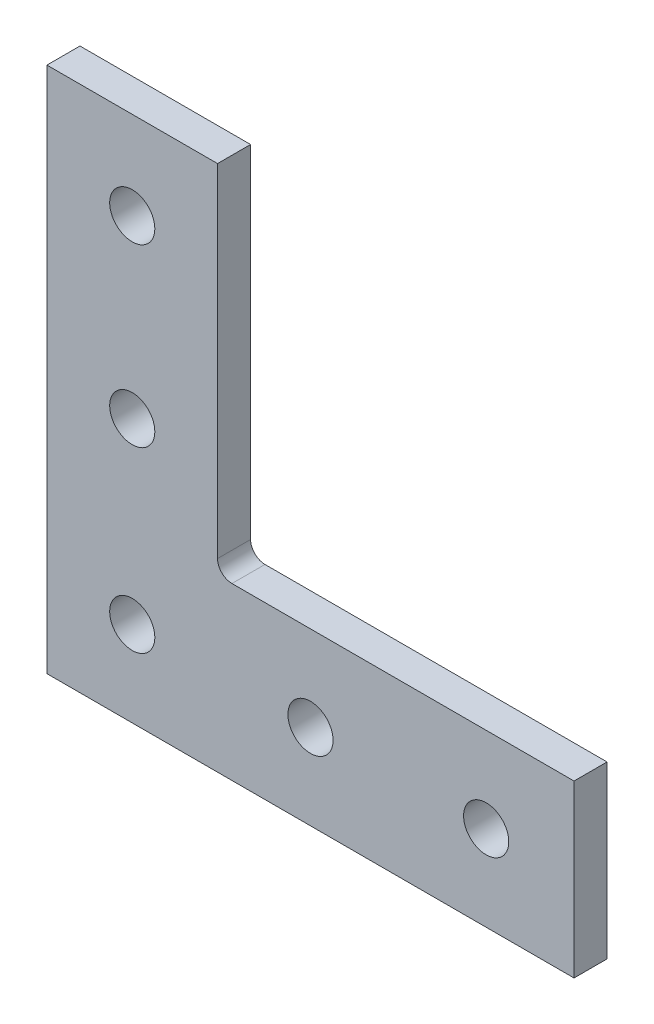
ISO-10303-21;
HEADER;
FILE_DESCRIPTION(('STEP AP214'),'2;1');
FILE_NAME('part.step','',(''),(''),'','','');
FILE_SCHEMA(('AUTOMOTIVE_DESIGN { 1 0 10303 214 1 1 1 1 }'));
ENDSEC;
DATA;
#1=APPLICATION_CONTEXT('core data for automotive mechanical design processes');
#2=APPLICATION_PROTOCOL_DEFINITION('international standard','automotive_design',2000,#1);
#3=PRODUCT_CONTEXT('',#1,'mechanical');
#4=PRODUCT('Part','Part','',(#3));
#5=PRODUCT_RELATED_PRODUCT_CATEGORY('part','',(#4));
#6=PRODUCT_DEFINITION_FORMATION('','',#4);
#7=PRODUCT_DEFINITION_CONTEXT('part definition',#1,'design');
#8=PRODUCT_DEFINITION('design','',#6,#7);
#9=PRODUCT_DEFINITION_SHAPE('','',#8);
#10=(LENGTH_UNIT() NAMED_UNIT(*) SI_UNIT(.MILLI.,.METRE.));
#11=(NAMED_UNIT(*) PLANE_ANGLE_UNIT() SI_UNIT($,.RADIAN.));
#12=(NAMED_UNIT(*) SI_UNIT($,.STERADIAN.) SOLID_ANGLE_UNIT());
#13=UNCERTAINTY_MEASURE_WITH_UNIT(LENGTH_MEASURE(1.E-05),#10,'distance_accuracy_value','');
#14=(GEOMETRIC_REPRESENTATION_CONTEXT(3) GLOBAL_UNCERTAINTY_ASSIGNED_CONTEXT((#13)) GLOBAL_UNIT_ASSIGNED_CONTEXT((#10,
#11,#12)) REPRESENTATION_CONTEXT('',''));
#15=CARTESIAN_POINT('',(0.,0.,0.));
#16=DIRECTION('',(0.,0.,1.));
#17=DIRECTION('',(1.,0.,0.));
#18=AXIS2_PLACEMENT_3D('',#15,#16,#17);
#19=CARTESIAN_POINT('',(-13.4366,-11.3538,-2.3876));
#20=DIRECTION('',(1.,0.,0.));
#21=DIRECTION('',(0.,1.,0.));
#22=AXIS2_PLACEMENT_3D('',#19,#20,#21);
#23=PLANE('',#22);
#24=DIRECTION('',(0.,0.,1.));
#25=VECTOR('',#24,1.);
#26=CARTESIAN_POINT('',(-13.4366,38.1,-2.3876));
#27=LINE('',#26,#25);
#28=CARTESIAN_POINT('',(-13.4366,38.1,-2.3876));
#29=VERTEX_POINT('',#28);
#30=CARTESIAN_POINT('',(-13.4366,38.1,2.3876));
#31=VERTEX_POINT('',#30);
#32=EDGE_CURVE('E88',#29,#31,#27,.T.);
#33=ORIENTED_EDGE('',*,*,#32,.T.);
#34=DIRECTION('',(0.,1.,0.));
#35=VECTOR('',#34,1.);
#36=CARTESIAN_POINT('',(-13.4366,-11.3538,2.3876));
#37=LINE('',#36,#35);
#38=CARTESIAN_POINT('',(-13.4366,-11.3538,2.3876));
#39=VERTEX_POINT('',#38);
#40=EDGE_CURVE('E91',#39,#31,#37,.T.);
#41=ORIENTED_EDGE('',*,*,#40,.F.);
#42=DIRECTION('',(0.,0.,1.));
#43=VECTOR('',#42,1.);
#44=CARTESIAN_POINT('',(-13.4366,-11.3538,-2.3876));
#45=LINE('',#44,#43);
#46=CARTESIAN_POINT('',(-13.4366,-11.3538,-2.3876));
#47=VERTEX_POINT('',#46);
#48=EDGE_CURVE('E11',#47,#39,#45,.T.);
#49=ORIENTED_EDGE('',*,*,#48,.F.);
#50=DIRECTION('',(0.,1.,0.));
#51=VECTOR('',#50,1.);
#52=CARTESIAN_POINT('',(-13.4366,-11.3538,-2.3876));
#53=LINE('',#52,#51);
#54=EDGE_CURVE('E92',#47,#29,#53,.T.);
#55=ORIENTED_EDGE('',*,*,#54,.T.);
#56=EDGE_LOOP('',(#33,#41,#49,#55));
#57=FACE_BOUND('',#56,.T.);
#58=ADVANCED_FACE('F32',(#57),#23,.T.);
#59=CARTESIAN_POINT('',(-11.3538,-11.3538,-2.3876));
#60=DIRECTION('',(0.,0.,1.));
#61=DIRECTION('',(1.,0.,0.));
#62=AXIS2_PLACEMENT_3D('',#59,#60,#61);
#63=CYLINDRICAL_SURFACE('',#62,2.0828);
#64=ORIENTED_EDGE('',*,*,#48,.T.);
#65=CARTESIAN_POINT('',(-11.3538,-11.3538,2.3876));
#66=DIRECTION('',(0.,0.,-1.));
#67=DIRECTION('',(-1.,0.,0.));
#68=AXIS2_PLACEMENT_3D('',#65,#66,#67);
#69=CIRCLE('',#68,2.0828);
#70=CARTESIAN_POINT('',(-11.3538,-13.4366,2.3876));
#71=VERTEX_POINT('',#70);
#72=EDGE_CURVE('E110',#71,#39,#69,.T.);
#73=ORIENTED_EDGE('',*,*,#72,.F.);
#74=DIRECTION('',(0.,0.,1.));
#75=VECTOR('',#74,1.);
#76=CARTESIAN_POINT('',(-11.3538,-13.4366,-2.3876));
#77=LINE('',#76,#75);
#78=CARTESIAN_POINT('',(-11.3538,-13.4366,-2.3876));
#79=VERTEX_POINT('',#78);
#80=EDGE_CURVE('E40',#79,#71,#77,.T.);
#81=ORIENTED_EDGE('',*,*,#80,.F.);
#82=CARTESIAN_POINT('',(-11.3538,-11.3538,-2.3876));
#83=DIRECTION('',(0.,0.,-1.));
#84=DIRECTION('',(-1.,0.,0.));
#85=AXIS2_PLACEMENT_3D('',#82,#83,#84);
#86=CIRCLE('',#85,2.0828);
#87=EDGE_CURVE('E97',#79,#47,#86,.T.);
#88=ORIENTED_EDGE('',*,*,#87,.T.);
#89=EDGE_LOOP('',(#64,#73,#81,#88));
#90=FACE_BOUND('',#89,.T.);
#91=ADVANCED_FACE('F183',(#90),#63,.F.);
#92=CARTESIAN_POINT('',(38.1,-13.4366,-2.3876));
#93=DIRECTION('',(0.,1.,0.));
#94=DIRECTION('',(-1.,0.,0.));
#95=AXIS2_PLACEMENT_3D('',#92,#93,#94);
#96=PLANE('',#95);
#97=ORIENTED_EDGE('',*,*,#80,.T.);
#98=DIRECTION('',(-1.,0.,0.));
#99=VECTOR('',#98,1.);
#100=CARTESIAN_POINT('',(38.1,-13.4366,2.3876));
#101=LINE('',#100,#99);
#102=CARTESIAN_POINT('',(38.1,-13.4366,2.3876));
#103=VERTEX_POINT('',#102);
#104=EDGE_CURVE('E125',#103,#71,#101,.T.);
#105=ORIENTED_EDGE('',*,*,#104,.F.);
#106=DIRECTION('',(0.,0.,1.));
#107=VECTOR('',#106,1.);
#108=CARTESIAN_POINT('',(38.1,-13.4366,-2.3876));
#109=LINE('',#108,#107);
#110=CARTESIAN_POINT('',(38.1,-13.4366,-2.3876));
#111=VERTEX_POINT('',#110);
#112=EDGE_CURVE('E144',#111,#103,#109,.T.);
#113=ORIENTED_EDGE('',*,*,#112,.F.);
#114=DIRECTION('',(-1.,0.,0.));
#115=VECTOR('',#114,1.);
#116=CARTESIAN_POINT('',(38.1,-13.4366,-2.3876));
#117=LINE('',#116,#115);
#118=EDGE_CURVE('E140',#111,#79,#117,.T.);
#119=ORIENTED_EDGE('',*,*,#118,.T.);
#120=EDGE_LOOP('',(#97,#105,#113,#119));
#121=FACE_BOUND('',#120,.T.);
#122=ADVANCED_FACE('F187',(#121),#96,.T.);
#123=CARTESIAN_POINT('',(38.1,-38.1,-2.3876));
#124=DIRECTION('',(1.,0.,0.));
#125=DIRECTION('',(0.,0.,-1.));
#126=AXIS2_PLACEMENT_3D('',#123,#124,#125);
#127=PLANE('',#126);
#128=ORIENTED_EDGE('',*,*,#112,.T.);
#129=DIRECTION('',(0.,1.,0.));
#130=VECTOR('',#129,1.);
#131=CARTESIAN_POINT('',(38.1,-38.1,2.3876));
#132=LINE('',#131,#130);
#133=CARTESIAN_POINT('',(38.1,-38.1,2.3876));
#134=VERTEX_POINT('',#133);
#135=EDGE_CURVE('E122',#134,#103,#132,.T.);
#136=ORIENTED_EDGE('',*,*,#135,.F.);
#137=DIRECTION('',(0.,0.,1.));
#138=VECTOR('',#137,1.);
#139=CARTESIAN_POINT('',(38.1,-38.1,-2.3876));
#140=LINE('',#139,#138);
#141=CARTESIAN_POINT('',(38.1,-38.1,-2.3876));
#142=VERTEX_POINT('',#141);
#143=EDGE_CURVE('E146',#142,#134,#140,.T.);
#144=ORIENTED_EDGE('',*,*,#143,.F.);
#145=DIRECTION('',(0.,1.,0.));
#146=VECTOR('',#145,1.);
#147=CARTESIAN_POINT('',(38.1,-38.1,-2.3876));
#148=LINE('',#147,#146);
#149=EDGE_CURVE('E137',#142,#111,#148,.T.);
#150=ORIENTED_EDGE('',*,*,#149,.T.);
#151=EDGE_LOOP('',(#128,#136,#144,#150));
#152=FACE_BOUND('',#151,.T.);
#153=ADVANCED_FACE('F192',(#152),#127,.T.);
#154=CARTESIAN_POINT('',(-38.1,-38.1,-2.3876));
#155=DIRECTION('',(0.,-1.,0.));
#156=DIRECTION('',(0.,0.,-1.));
#157=AXIS2_PLACEMENT_3D('',#154,#155,#156);
#158=PLANE('',#157);
#159=ORIENTED_EDGE('',*,*,#143,.T.);
#160=DIRECTION('',(1.,0.,0.));
#161=VECTOR('',#160,1.);
#162=CARTESIAN_POINT('',(-38.1,-38.1,2.3876));
#163=LINE('',#162,#161);
#164=CARTESIAN_POINT('',(-38.1,-38.1,2.3876));
#165=VERTEX_POINT('',#164);
#166=EDGE_CURVE('E119',#165,#134,#163,.T.);
#167=ORIENTED_EDGE('',*,*,#166,.F.);
#168=DIRECTION('',(0.,0.,1.));
#169=VECTOR('',#168,1.);
#170=CARTESIAN_POINT('',(-38.1,-38.1,-2.3876));
#171=LINE('',#170,#169);
#172=CARTESIAN_POINT('',(-38.1,-38.1,-2.3876));
#173=VERTEX_POINT('',#172);
#174=EDGE_CURVE('E148',#173,#165,#171,.T.);
#175=ORIENTED_EDGE('',*,*,#174,.F.);
#176=DIRECTION('',(1.,0.,0.));
#177=VECTOR('',#176,1.);
#178=CARTESIAN_POINT('',(-38.1,-38.1,-2.3876));
#179=LINE('',#178,#177);
#180=EDGE_CURVE('E134',#173,#142,#179,.T.);
#181=ORIENTED_EDGE('',*,*,#180,.T.);
#182=EDGE_LOOP('',(#159,#167,#175,#181));
#183=FACE_BOUND('',#182,.T.);
#184=ADVANCED_FACE('F201',(#183),#158,.T.);
#185=CARTESIAN_POINT('',(-38.1,38.1,-2.3876));
#186=DIRECTION('',(-1.,0.,0.));
#187=DIRECTION('',(0.,-1.,0.));
#188=AXIS2_PLACEMENT_3D('',#185,#186,#187);
#189=PLANE('',#188);
#190=ORIENTED_EDGE('',*,*,#174,.T.);
#191=DIRECTION('',(0.,-1.,0.));
#192=VECTOR('',#191,1.);
#193=CARTESIAN_POINT('',(-38.1,38.1,2.3876));
#194=LINE('',#193,#192);
#195=CARTESIAN_POINT('',(-38.1,38.1,2.3876));
#196=VERTEX_POINT('',#195);
#197=EDGE_CURVE('E105',#196,#165,#194,.T.);
#198=ORIENTED_EDGE('',*,*,#197,.F.);
#199=DIRECTION('',(0.,0.,1.));
#200=VECTOR('',#199,1.);
#201=CARTESIAN_POINT('',(-38.1,38.1,-2.3876));
#202=LINE('',#201,#200);
#203=CARTESIAN_POINT('',(-38.1,38.1,-2.3876));
#204=VERTEX_POINT('',#203);
#205=EDGE_CURVE('E96',#204,#196,#202,.T.);
#206=ORIENTED_EDGE('',*,*,#205,.F.);
#207=DIRECTION('',(0.,-1.,0.));
#208=VECTOR('',#207,1.);
#209=CARTESIAN_POINT('',(-38.1,38.1,-2.3876));
#210=LINE('',#209,#208);
#211=EDGE_CURVE('E131',#204,#173,#210,.T.);
#212=ORIENTED_EDGE('',*,*,#211,.T.);
#213=EDGE_LOOP('',(#190,#198,#206,#212));
#214=FACE_BOUND('',#213,.T.);
#215=ADVANCED_FACE('F205',(#214),#189,.T.);
#216=CARTESIAN_POINT('',(-13.4366,38.1,-2.3876));
#217=DIRECTION('',(0.,1.,0.));
#218=DIRECTION('',(0.,0.,1.));
#219=AXIS2_PLACEMENT_3D('',#216,#217,#218);
#220=PLANE('',#219);
#221=ORIENTED_EDGE('',*,*,#205,.T.);
#222=DIRECTION('',(-1.,0.,0.));
#223=VECTOR('',#222,1.);
#224=CARTESIAN_POINT('',(-13.4366,38.1,2.3876));
#225=LINE('',#224,#223);
#226=EDGE_CURVE('E100',#31,#196,#225,.T.);
#227=ORIENTED_EDGE('',*,*,#226,.F.);
#228=ORIENTED_EDGE('',*,*,#32,.F.);
#229=DIRECTION('',(-1.,0.,0.));
#230=VECTOR('',#229,1.);
#231=CARTESIAN_POINT('',(-13.4366,38.1,-2.3876));
#232=LINE('',#231,#230);
#233=EDGE_CURVE('E129',#29,#204,#232,.T.);
#234=ORIENTED_EDGE('',*,*,#233,.T.);
#235=EDGE_LOOP('',(#221,#227,#228,#234));
#236=FACE_BOUND('',#235,.T.);
#237=ADVANCED_FACE('F101',(#236),#220,.T.);
#238=CARTESIAN_POINT('',(-11.3538,-11.3538,-2.3876));
#239=DIRECTION('',(0.,0.,-1.));
#240=DIRECTION('',(-1.,0.,0.));
#241=AXIS2_PLACEMENT_3D('',#238,#239,#240);
#242=PLANE('',#241);
#243=CARTESIAN_POINT('',(-25.7683,25.4,-2.3876));
#244=DIRECTION('',(0.,0.,1.));
#245=DIRECTION('',(1.,0.,0.));
#246=AXIS2_PLACEMENT_3D('',#243,#244,#245);
#247=CIRCLE('',#246,3.2639);
#248=CARTESIAN_POINT('',(-22.5044,25.4,-2.3876));
#249=VERTEX_POINT('',#248);
#250=EDGE_CURVE('E155',#249,#249,#247,.T.);
#251=ORIENTED_EDGE('',*,*,#250,.T.);
#252=EDGE_LOOP('',(#251));
#253=FACE_BOUND('',#252,.T.);
#254=CARTESIAN_POINT('',(-25.7683,-25.7683,-2.3876));
#255=DIRECTION('',(0.,0.,1.));
#256=DIRECTION('',(1.,0.,0.));
#257=AXIS2_PLACEMENT_3D('',#254,#255,#256);
#258=CIRCLE('',#257,3.2639);
#259=CARTESIAN_POINT('',(-22.5044,-25.7683,-2.3876));
#260=VERTEX_POINT('',#259);
#261=EDGE_CURVE('E224',#260,#260,#258,.T.);
#262=ORIENTED_EDGE('',*,*,#261,.T.);
#263=EDGE_LOOP('',(#262));
#264=FACE_BOUND('',#263,.T.);
#265=CARTESIAN_POINT('',(25.4,-25.7683,-2.3876));
#266=DIRECTION('',(0.,0.,1.));
#267=DIRECTION('',(-1.,0.,0.));
#268=AXIS2_PLACEMENT_3D('',#265,#266,#267);
#269=CIRCLE('',#268,3.26390000000001);
#270=CARTESIAN_POINT('',(22.1361,-25.7683,-2.3876));
#271=VERTEX_POINT('',#270);
#272=EDGE_CURVE('E228',#271,#271,#269,.T.);
#273=ORIENTED_EDGE('',*,*,#272,.T.);
#274=EDGE_LOOP('',(#273));
#275=FACE_BOUND('',#274,.T.);
#276=CARTESIAN_POINT('',(0.,-25.7683,-2.3876));
#277=DIRECTION('',(0.,0.,1.));
#278=DIRECTION('',(-1.,0.,0.));
#279=AXIS2_PLACEMENT_3D('',#276,#277,#278);
#280=CIRCLE('',#279,3.26389999999999);
#281=CARTESIAN_POINT('',(-3.26389999999999,-25.7683,-2.3876));
#282=VERTEX_POINT('',#281);
#283=EDGE_CURVE('E115',#282,#282,#280,.T.);
#284=ORIENTED_EDGE('',*,*,#283,.T.);
#285=EDGE_LOOP('',(#284));
#286=FACE_BOUND('',#285,.T.);
#287=CARTESIAN_POINT('',(-25.7683,0.,-2.3876));
#288=DIRECTION('',(0.,0.,1.));
#289=DIRECTION('',(1.,0.,0.));
#290=AXIS2_PLACEMENT_3D('',#287,#288,#289);
#291=CIRCLE('',#290,3.2639);
#292=CARTESIAN_POINT('',(-22.5044,0.,-2.3876));
#293=VERTEX_POINT('',#292);
#294=EDGE_CURVE('E235',#293,#293,#291,.T.);
#295=ORIENTED_EDGE('',*,*,#294,.T.);
#296=EDGE_LOOP('',(#295));
#297=FACE_BOUND('',#296,.T.);
#298=ORIENTED_EDGE('',*,*,#54,.F.);
#299=ORIENTED_EDGE('',*,*,#87,.F.);
#300=ORIENTED_EDGE('',*,*,#118,.F.);
#301=ORIENTED_EDGE('',*,*,#149,.F.);
#302=ORIENTED_EDGE('',*,*,#180,.F.);
#303=ORIENTED_EDGE('',*,*,#211,.F.);
#304=ORIENTED_EDGE('',*,*,#233,.F.);
#305=EDGE_LOOP('',(#298,#299,#300,#301,#302,#303,#304));
#306=FACE_BOUND('',#305,.T.);
#307=ADVANCED_FACE('F196',(#253,#264,#275,#286,#297,#306),#242,.T.);
#308=CARTESIAN_POINT('',(-11.3538,-11.3538,2.3876));
#309=DIRECTION('',(0.,0.,-1.));
#310=DIRECTION('',(-1.,0.,0.));
#311=AXIS2_PLACEMENT_3D('',#308,#309,#310);
#312=PLANE('',#311);
#313=CARTESIAN_POINT('',(-25.7683,25.4,2.3876));
#314=DIRECTION('',(0.,0.,-1.));
#315=DIRECTION('',(-1.,0.,0.));
#316=AXIS2_PLACEMENT_3D('',#313,#314,#315);
#317=CIRCLE('',#316,3.2639);
#318=CARTESIAN_POINT('',(-29.0322,25.4,2.3876));
#319=VERTEX_POINT('',#318);
#320=EDGE_CURVE('E35',#319,#319,#317,.T.);
#321=ORIENTED_EDGE('',*,*,#320,.T.);
#322=EDGE_LOOP('',(#321));
#323=FACE_BOUND('',#322,.T.);
#324=CARTESIAN_POINT('',(-25.7683,-25.7683,2.3876));
#325=DIRECTION('',(0.,0.,-1.));
#326=DIRECTION('',(-1.,0.,0.));
#327=AXIS2_PLACEMENT_3D('',#324,#325,#326);
#328=CIRCLE('',#327,3.2639);
#329=CARTESIAN_POINT('',(-29.0322,-25.7683,2.3876));
#330=VERTEX_POINT('',#329);
#331=EDGE_CURVE('E113',#330,#330,#328,.T.);
#332=ORIENTED_EDGE('',*,*,#331,.T.);
#333=EDGE_LOOP('',(#332));
#334=FACE_BOUND('',#333,.T.);
#335=CARTESIAN_POINT('',(25.4,-25.7683,2.3876));
#336=DIRECTION('',(0.,0.,-1.));
#337=DIRECTION('',(-1.,0.,0.));
#338=AXIS2_PLACEMENT_3D('',#335,#336,#337);
#339=CIRCLE('',#338,3.26390000000001);
#340=CARTESIAN_POINT('',(22.1361,-25.7683,2.3876));
#341=VERTEX_POINT('',#340);
#342=EDGE_CURVE('E158',#341,#341,#339,.T.);
#343=ORIENTED_EDGE('',*,*,#342,.T.);
#344=EDGE_LOOP('',(#343));
#345=FACE_BOUND('',#344,.T.);
#346=CARTESIAN_POINT('',(0.,-25.7683,2.3876));
#347=DIRECTION('',(0.,0.,-1.));
#348=DIRECTION('',(-1.,0.,0.));
#349=AXIS2_PLACEMENT_3D('',#346,#347,#348);
#350=CIRCLE('',#349,3.26389999999999);
#351=CARTESIAN_POINT('',(-3.26389999999999,-25.7683,2.3876));
#352=VERTEX_POINT('',#351);
#353=EDGE_CURVE('E154',#352,#352,#350,.T.);
#354=ORIENTED_EDGE('',*,*,#353,.T.);
#355=EDGE_LOOP('',(#354));
#356=FACE_BOUND('',#355,.T.);
#357=CARTESIAN_POINT('',(-25.7683,0.,2.3876));
#358=DIRECTION('',(0.,0.,-1.));
#359=DIRECTION('',(-1.,0.,0.));
#360=AXIS2_PLACEMENT_3D('',#357,#358,#359);
#361=CIRCLE('',#360,3.2639);
#362=CARTESIAN_POINT('',(-29.0322,0.,2.3876));
#363=VERTEX_POINT('',#362);
#364=EDGE_CURVE('E151',#363,#363,#361,.T.);
#365=ORIENTED_EDGE('',*,*,#364,.T.);
#366=EDGE_LOOP('',(#365));
#367=FACE_BOUND('',#366,.T.);
#368=ORIENTED_EDGE('',*,*,#40,.T.);
#369=ORIENTED_EDGE('',*,*,#226,.T.);
#370=ORIENTED_EDGE('',*,*,#197,.T.);
#371=ORIENTED_EDGE('',*,*,#166,.T.);
#372=ORIENTED_EDGE('',*,*,#135,.T.);
#373=ORIENTED_EDGE('',*,*,#104,.T.);
#374=ORIENTED_EDGE('',*,*,#72,.T.);
#375=EDGE_LOOP('',(#368,#369,#370,#371,#372,#373,#374));
#376=FACE_BOUND('',#375,.T.);
#377=ADVANCED_FACE('F108',(#323,#334,#345,#356,#367,#376),#312,.F.);
#378=CARTESIAN_POINT('',(-25.7683,0.,-2.3876));
#379=DIRECTION('',(0.,0.,1.));
#380=DIRECTION('',(1.,0.,0.));
#381=AXIS2_PLACEMENT_3D('',#378,#379,#380);
#382=CYLINDRICAL_SURFACE('',#381,3.2639);
#383=ORIENTED_EDGE('',*,*,#294,.F.);
#384=EDGE_LOOP('',(#383));
#385=FACE_BOUND('',#384,.T.);
#386=ORIENTED_EDGE('',*,*,#364,.F.);
#387=EDGE_LOOP('',(#386));
#388=FACE_BOUND('',#387,.T.);
#389=ADVANCED_FACE('F217',(#385,#388),#382,.F.);
#390=CARTESIAN_POINT('',(0.,-25.7683,-2.3876));
#391=DIRECTION('',(0.,0.,1.));
#392=DIRECTION('',(1.,0.,0.));
#393=AXIS2_PLACEMENT_3D('',#390,#391,#392);
#394=CYLINDRICAL_SURFACE('',#393,3.26389999999999);
#395=ORIENTED_EDGE('',*,*,#283,.F.);
#396=EDGE_LOOP('',(#395));
#397=FACE_BOUND('',#396,.T.);
#398=ORIENTED_EDGE('',*,*,#353,.F.);
#399=EDGE_LOOP('',(#398));
#400=FACE_BOUND('',#399,.T.);
#401=ADVANCED_FACE('F177',(#397,#400),#394,.F.);
#402=CARTESIAN_POINT('',(25.4,-25.7683,-2.3876));
#403=DIRECTION('',(0.,0.,1.));
#404=DIRECTION('',(1.,0.,0.));
#405=AXIS2_PLACEMENT_3D('',#402,#403,#404);
#406=CYLINDRICAL_SURFACE('',#405,3.26390000000001);
#407=ORIENTED_EDGE('',*,*,#272,.F.);
#408=EDGE_LOOP('',(#407));
#409=FACE_BOUND('',#408,.T.);
#410=ORIENTED_EDGE('',*,*,#342,.F.);
#411=EDGE_LOOP('',(#410));
#412=FACE_BOUND('',#411,.T.);
#413=ADVANCED_FACE('F168',(#409,#412),#406,.F.);
#414=CARTESIAN_POINT('',(-25.7683,-25.7683,-2.3876));
#415=DIRECTION('',(0.,0.,1.));
#416=DIRECTION('',(1.,0.,0.));
#417=AXIS2_PLACEMENT_3D('',#414,#415,#416);
#418=CYLINDRICAL_SURFACE('',#417,3.2639);
#419=ORIENTED_EDGE('',*,*,#261,.F.);
#420=EDGE_LOOP('',(#419));
#421=FACE_BOUND('',#420,.T.);
#422=ORIENTED_EDGE('',*,*,#331,.F.);
#423=EDGE_LOOP('',(#422));
#424=FACE_BOUND('',#423,.T.);
#425=ADVANCED_FACE('F165',(#421,#424),#418,.F.);
#426=CARTESIAN_POINT('',(-25.7683,25.4,-2.3876));
#427=DIRECTION('',(0.,0.,1.));
#428=DIRECTION('',(1.,0.,0.));
#429=AXIS2_PLACEMENT_3D('',#426,#427,#428);
#430=CYLINDRICAL_SURFACE('',#429,3.2639);
#431=ORIENTED_EDGE('',*,*,#250,.F.);
#432=EDGE_LOOP('',(#431));
#433=FACE_BOUND('',#432,.T.);
#434=ORIENTED_EDGE('',*,*,#320,.F.);
#435=EDGE_LOOP('',(#434));
#436=FACE_BOUND('',#435,.T.);
#437=ADVANCED_FACE('F167',(#433,#436),#430,.F.);
#438=CLOSED_SHELL('',(#58,#91,#122,#153,#184,#215,#237,#307,#377,#389,#401,#413,#425,#437));
#439=MANIFOLD_SOLID_BREP('B2',#438);
#440=ADVANCED_BREP_SHAPE_REPRESENTATION('',(#18,#439),#14);
#441=SHAPE_DEFINITION_REPRESENTATION(#9,#440);
ENDSEC;
END-ISO-10303-21;
